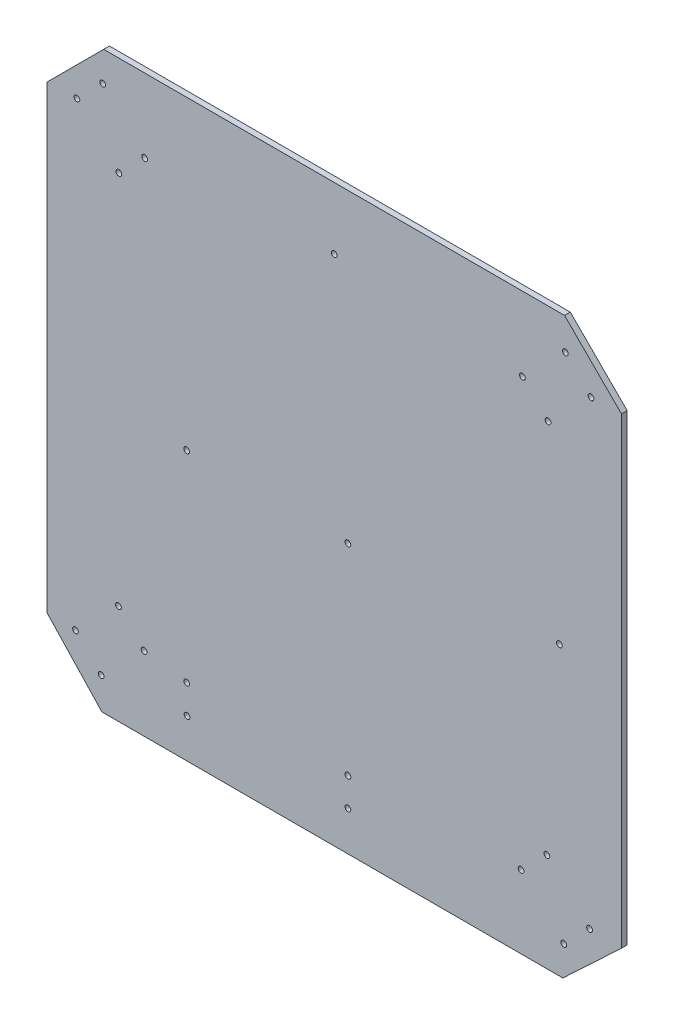
ISO-10303-21;
HEADER;
FILE_DESCRIPTION(('STEP AP214'),'2;1');
FILE_NAME('part.step','',(''),(''),'','','');
FILE_SCHEMA(('AUTOMOTIVE_DESIGN { 1 0 10303 214 1 1 1 1 }'));
ENDSEC;
DATA;
#1=APPLICATION_CONTEXT('core data for automotive mechanical design processes');
#2=APPLICATION_PROTOCOL_DEFINITION('international standard','automotive_design',2000,#1);
#3=PRODUCT_CONTEXT('',#1,'mechanical');
#4=PRODUCT('Part','Part','',(#3));
#5=PRODUCT_RELATED_PRODUCT_CATEGORY('part','',(#4));
#6=PRODUCT_DEFINITION_FORMATION('','',#4);
#7=PRODUCT_DEFINITION_CONTEXT('part definition',#1,'design');
#8=PRODUCT_DEFINITION('design','',#6,#7);
#9=PRODUCT_DEFINITION_SHAPE('','',#8);
#10=(LENGTH_UNIT() NAMED_UNIT(*) SI_UNIT(.MILLI.,.METRE.));
#11=(NAMED_UNIT(*) PLANE_ANGLE_UNIT() SI_UNIT($,.RADIAN.));
#12=(NAMED_UNIT(*) SI_UNIT($,.STERADIAN.) SOLID_ANGLE_UNIT());
#13=UNCERTAINTY_MEASURE_WITH_UNIT(LENGTH_MEASURE(1.E-05),#10,'distance_accuracy_value','');
#14=(GEOMETRIC_REPRESENTATION_CONTEXT(3) GLOBAL_UNCERTAINTY_ASSIGNED_CONTEXT((#13)) GLOBAL_UNIT_ASSIGNED_CONTEXT((#10,
#11,#12)) REPRESENTATION_CONTEXT('',''));
#15=CARTESIAN_POINT('',(0.,0.,0.));
#16=DIRECTION('',(0.,0.,1.));
#17=DIRECTION('',(1.,0.,0.));
#18=AXIS2_PLACEMENT_3D('',#15,#16,#17);
#19=CARTESIAN_POINT('',(0.,0.,5.));
#20=DIRECTION('',(0.,0.,-1.));
#21=DIRECTION('',(-1.,0.,0.));
#22=AXIS2_PLACEMENT_3D('',#19,#20,#21);
#23=PLANE('',#22);
#24=CARTESIAN_POINT('',(0.,196.,5.));
#25=DIRECTION('',(0.,0.,1.));
#26=DIRECTION('',(1.,0.,0.));
#27=AXIS2_PLACEMENT_3D('',#24,#25,#26);
#28=CIRCLE('',#27,2.5);
#29=CARTESIAN_POINT('',(2.50000000000001,196.,5.));
#30=VERTEX_POINT('',#29);
#31=EDGE_CURVE('E301',#30,#30,#28,.T.);
#32=ORIENTED_EDGE('',*,*,#31,.F.);
#33=EDGE_LOOP('',(#32));
#34=FACE_BOUND('',#33,.T.);
#35=CARTESIAN_POINT('',(196.,0.,5.));
#36=DIRECTION('',(0.,0.,1.));
#37=DIRECTION('',(1.,0.,0.));
#38=AXIS2_PLACEMENT_3D('',#35,#36,#37);
#39=CIRCLE('',#38,2.5);
#40=CARTESIAN_POINT('',(198.5,0.,5.));
#41=VERTEX_POINT('',#40);
#42=EDGE_CURVE('E295',#41,#41,#39,.T.);
#43=ORIENTED_EDGE('',*,*,#42,.F.);
#44=EDGE_LOOP('',(#43));
#45=FACE_BOUND('',#44,.T.);
#46=CARTESIAN_POINT('',(12.,-215.715271889631,5.));
#47=DIRECTION('',(0.,0.,1.));
#48=DIRECTION('',(1.,0.,0.));
#49=AXIS2_PLACEMENT_3D('',#46,#47,#48);
#50=CIRCLE('',#49,2.5);
#51=CARTESIAN_POINT('',(14.5,-215.715271889631,5.));
#52=VERTEX_POINT('',#51);
#53=EDGE_CURVE('E290',#52,#52,#50,.T.);
#54=ORIENTED_EDGE('',*,*,#53,.F.);
#55=EDGE_LOOP('',(#54));
#56=FACE_BOUND('',#55,.T.);
#57=CARTESIAN_POINT('',(12.,-191.,5.));
#58=DIRECTION('',(0.,0.,1.));
#59=DIRECTION('',(1.,0.,0.));
#60=AXIS2_PLACEMENT_3D('',#57,#58,#59);
#61=CIRCLE('',#60,2.5);
#62=CARTESIAN_POINT('',(14.5,-191.,5.));
#63=VERTEX_POINT('',#62);
#64=EDGE_CURVE('E284',#63,#63,#61,.T.);
#65=ORIENTED_EDGE('',*,*,#64,.F.);
#66=EDGE_LOOP('',(#65));
#67=FACE_BOUND('',#66,.T.);
#68=CARTESIAN_POINT('',(12.,-16.,5.));
#69=DIRECTION('',(0.,0.,1.));
#70=DIRECTION('',(1.,0.,0.));
#71=AXIS2_PLACEMENT_3D('',#68,#69,#70);
#72=CIRCLE('',#71,2.49999999999999);
#73=CARTESIAN_POINT('',(14.5,-16.,5.));
#74=VERTEX_POINT('',#73);
#75=EDGE_CURVE('E277',#74,#74,#72,.T.);
#76=ORIENTED_EDGE('',*,*,#75,.F.);
#77=EDGE_LOOP('',(#76));
#78=FACE_BOUND('',#77,.T.);
#79=CARTESIAN_POINT('',(-128.,-216.,5.));
#80=DIRECTION('',(0.,0.,1.));
#81=DIRECTION('',(1.,0.,0.));
#82=AXIS2_PLACEMENT_3D('',#79,#80,#81);
#83=CIRCLE('',#82,2.5);
#84=CARTESIAN_POINT('',(-125.5,-216.,5.));
#85=VERTEX_POINT('',#84);
#86=EDGE_CURVE('E272',#85,#85,#83,.T.);
#87=ORIENTED_EDGE('',*,*,#86,.F.);
#88=EDGE_LOOP('',(#87));
#89=FACE_BOUND('',#88,.T.);
#90=CARTESIAN_POINT('',(-128.284639799697,-191.,5.));
#91=DIRECTION('',(0.,0.,1.));
#92=DIRECTION('',(1.,0.,0.));
#93=AXIS2_PLACEMENT_3D('',#90,#91,#92);
#94=CIRCLE('',#93,2.5);
#95=CARTESIAN_POINT('',(-125.784639799697,-191.,5.));
#96=VERTEX_POINT('',#95);
#97=EDGE_CURVE('E266',#96,#96,#94,.T.);
#98=ORIENTED_EDGE('',*,*,#97,.F.);
#99=EDGE_LOOP('',(#98));
#100=FACE_BOUND('',#99,.T.);
#101=CARTESIAN_POINT('',(-128.284639799697,-16.,5.));
#102=DIRECTION('',(0.,0.,1.));
#103=DIRECTION('',(1.,0.,0.));
#104=AXIS2_PLACEMENT_3D('',#101,#102,#103);
#105=CIRCLE('',#104,2.5);
#106=CARTESIAN_POINT('',(-125.784639799697,-16.,5.));
#107=VERTEX_POINT('',#106);
#108=EDGE_CURVE('E259',#107,#107,#105,.T.);
#109=ORIENTED_EDGE('',*,*,#108,.F.);
#110=EDGE_LOOP('',(#109));
#111=FACE_BOUND('',#110,.T.);
#112=CARTESIAN_POINT('',(222.253825997563,-201.338953508415,5.));
#113=DIRECTION('',(0.,0.,1.));
#114=DIRECTION('',(1.,0.,0.));
#115=AXIS2_PLACEMENT_3D('',#112,#113,#114);
#116=CIRCLE('',#115,2.49999999999991);
#117=CARTESIAN_POINT('',(224.753825997563,-201.338953508415,5.));
#118=VERTEX_POINT('',#117);
#119=EDGE_CURVE('E197',#118,#118,#116,.T.);
#120=ORIENTED_EDGE('',*,*,#119,.F.);
#121=EDGE_LOOP('',(#120));
#122=FACE_BOUND('',#121,.T.);
#123=CARTESIAN_POINT('',(-187.659880850275,-163.046698366614,5.));
#124=DIRECTION('',(0.,0.,1.));
#125=DIRECTION('',(1.,0.,0.));
#126=AXIS2_PLACEMENT_3D('',#123,#124,#125);
#127=CIRCLE('',#126,2.49999999999979);
#128=CARTESIAN_POINT('',(-185.159880850275,-163.046698366614,5.));
#129=VERTEX_POINT('',#128);
#130=EDGE_CURVE('E208',#129,#129,#127,.T.);
#131=ORIENTED_EDGE('',*,*,#130,.F.);
#132=EDGE_LOOP('',(#131));
#133=FACE_BOUND('',#132,.T.);
#134=CARTESIAN_POINT('',(201.196010764225,222.516316524821,5.));
#135=DIRECTION('',(0.,0.,1.));
#136=DIRECTION('',(1.,0.,0.));
#137=AXIS2_PLACEMENT_3D('',#134,#135,#136);
#138=CIRCLE('',#137,2.50000000000002);
#139=CARTESIAN_POINT('',(203.696010764225,222.516316524821,5.));
#140=VERTEX_POINT('',#139);
#141=EDGE_CURVE('E179',#140,#140,#138,.T.);
#142=ORIENTED_EDGE('',*,*,#141,.F.);
#143=EDGE_LOOP('',(#142));
#144=FACE_BOUND('',#143,.T.);
#145=CARTESIAN_POINT('',(-187.311960925031,163.528745218922,5.));
#146=DIRECTION('',(0.,0.,1.));
#147=DIRECTION('',(1.,0.,0.));
#148=AXIS2_PLACEMENT_3D('',#145,#146,#147);
#149=CIRCLE('',#148,2.5);
#150=CARTESIAN_POINT('',(-184.811960925031,163.528745218922,5.));
#151=VERTEX_POINT('',#150);
#152=EDGE_CURVE('E185',#151,#151,#149,.T.);
#153=ORIENTED_EDGE('',*,*,#152,.F.);
#154=EDGE_LOOP('',(#153));
#155=FACE_BOUND('',#154,.T.);
#156=CARTESIAN_POINT('',(-164.861320622359,185.979385521595,5.));
#157=DIRECTION('',(0.,0.,1.));
#158=DIRECTION('',(1.,0.,0.));
#159=AXIS2_PLACEMENT_3D('',#156,#157,#158);
#160=CIRCLE('',#159,2.5);
#161=CARTESIAN_POINT('',(-162.361320622359,185.979385521595,5.));
#162=VERTEX_POINT('',#161);
#163=EDGE_CURVE('E251',#162,#162,#160,.T.);
#164=ORIENTED_EDGE('',*,*,#163,.F.);
#165=EDGE_LOOP('',(#164));
#166=FACE_BOUND('',#165,.T.);
#167=CARTESIAN_POINT('',(-202.724854759024,-222.548882873812,5.));
#168=DIRECTION('',(0.,0.,1.));
#169=DIRECTION('',(1.,0.,0.));
#170=AXIS2_PLACEMENT_3D('',#167,#168,#169);
#171=CIRCLE('',#170,2.50000000000006);
#172=CARTESIAN_POINT('',(-200.224854759024,-222.548882873812,5.));
#173=VERTEX_POINT('',#172);
#174=EDGE_CURVE('E241',#173,#173,#171,.T.);
#175=ORIENTED_EDGE('',*,*,#174,.F.);
#176=EDGE_LOOP('',(#175));
#177=FACE_BOUND('',#176,.T.);
#178=CARTESIAN_POINT('',(186.12725815601,163.015088849819,5.));
#179=DIRECTION('',(0.,0.,1.));
#180=DIRECTION('',(1.,0.,0.));
#181=AXIS2_PLACEMENT_3D('',#178,#179,#180);
#182=CIRCLE('',#181,2.49999999999982);
#183=CARTESIAN_POINT('',(188.62725815601,163.015088849819,5.));
#184=VERTEX_POINT('',#183);
#185=EDGE_CURVE('E233',#184,#184,#182,.T.);
#186=ORIENTED_EDGE('',*,*,#185,.F.);
#187=EDGE_LOOP('',(#186));
#188=FACE_BOUND('',#187,.T.);
#189=CARTESIAN_POINT('',(162.657933466483,-186.649059246577,5.));
#190=DIRECTION('',(0.,0.,1.));
#191=DIRECTION('',(1.,0.,0.));
#192=AXIS2_PLACEMENT_3D('',#189,#190,#191);
#193=CIRCLE('',#192,2.50000000000008);
#194=CARTESIAN_POINT('',(165.157933466483,-186.649059246577,5.));
#195=VERTEX_POINT('',#194);
#196=EDGE_CURVE('E220',#195,#195,#193,.T.);
#197=ORIENTED_EDGE('',*,*,#196,.F.);
#198=EDGE_LOOP('',(#197));
#199=FACE_BOUND('',#198,.T.);
#200=CARTESIAN_POINT('',(-223.784016087509,201.333375784836,5.));
#201=DIRECTION('',(0.,0.,1.));
#202=DIRECTION('',(1.,0.,0.));
#203=AXIS2_PLACEMENT_3D('',#200,#201,#202);
#204=CIRCLE('',#203,2.49999999999997);
#205=CARTESIAN_POINT('',(-221.284016087509,201.333375784836,5.));
#206=VERTEX_POINT('',#205);
#207=EDGE_CURVE('E163',#206,#206,#204,.T.);
#208=ORIENTED_EDGE('',*,*,#207,.F.);
#209=EDGE_LOOP('',(#208));
#210=FACE_BOUND('',#209,.T.);
#211=DIRECTION('',(0.,-1.,0.));
#212=VECTOR('',#211,1.);
#213=CARTESIAN_POINT('',(-250.,-250.,5.));
#214=LINE('',#213,#212);
#215=CARTESIAN_POINT('',(-250.,200.502525316942,5.));
#216=VERTEX_POINT('',#215);
#217=CARTESIAN_POINT('',(-250.,-198.96828586381,5.));
#218=VERTEX_POINT('',#217);
#219=EDGE_CURVE('E43',#216,#218,#214,.T.);
#220=ORIENTED_EDGE('',*,*,#219,.T.);
#221=DIRECTION('',(-0.684487615952459,0.729024487659858,0.));
#222=VECTOR('',#221,1.);
#223=CARTESIAN_POINT('',(-232.155988759174,-217.973335552749,5.));
#224=LINE('',#223,#222);
#225=CARTESIAN_POINT('',(-202.085866883328,-250.,5.));
#226=VERTEX_POINT('',#225);
#227=EDGE_CURVE('E148',#226,#218,#224,.T.);
#228=ORIENTED_EDGE('',*,*,#227,.F.);
#229=DIRECTION('',(1.,0.,0.));
#230=VECTOR('',#229,1.);
#231=CARTESIAN_POINT('',(-250.,-250.,5.));
#232=LINE('',#231,#230);
#233=CARTESIAN_POINT('',(198.96828586381,-250.,5.));
#234=VERTEX_POINT('',#233);
#235=EDGE_CURVE('E11',#226,#234,#232,.T.);
#236=ORIENTED_EDGE('',*,*,#235,.T.);
#237=DIRECTION('',(0.729024487659859,0.684487615952458,0.));
#238=VECTOR('',#237,1.);
#239=CARTESIAN_POINT('',(217.973335552748,-232.155988759174,5.));
#240=LINE('',#239,#238);
#241=CARTESIAN_POINT('',(250.,-202.085866883328,5.));
#242=VERTEX_POINT('',#241);
#243=EDGE_CURVE('E147',#234,#242,#240,.T.);
#244=ORIENTED_EDGE('',*,*,#243,.T.);
#245=DIRECTION('',(0.,1.,0.));
#246=VECTOR('',#245,1.);
#247=CARTESIAN_POINT('',(250.,-250.,5.));
#248=LINE('',#247,#246);
#249=CARTESIAN_POINT('',(250.,200.502525316942,5.));
#250=VERTEX_POINT('',#249);
#251=EDGE_CURVE('E134',#242,#250,#248,.T.);
#252=ORIENTED_EDGE('',*,*,#251,.T.);
#253=DIRECTION('',(0.707106781186548,-0.707106781186547,0.));
#254=VECTOR('',#253,1.);
#255=CARTESIAN_POINT('',(225.251262658471,225.251262658471,5.));
#256=LINE('',#255,#254);
#257=CARTESIAN_POINT('',(200.502525316942,250.,5.));
#258=VERTEX_POINT('',#257);
#259=EDGE_CURVE('E111',#258,#250,#256,.T.);
#260=ORIENTED_EDGE('',*,*,#259,.F.);
#261=DIRECTION('',(-1.,0.,0.));
#262=VECTOR('',#261,1.);
#263=CARTESIAN_POINT('',(-250.,250.,5.));
#264=LINE('',#263,#262);
#265=CARTESIAN_POINT('',(-200.502525316942,250.,5.));
#266=VERTEX_POINT('',#265);
#267=EDGE_CURVE('E119',#258,#266,#264,.T.);
#268=ORIENTED_EDGE('',*,*,#267,.T.);
#269=DIRECTION('',(0.707106781186547,0.707106781186549,0.));
#270=VECTOR('',#269,1.);
#271=CARTESIAN_POINT('',(-225.251262658471,225.251262658471,5.));
#272=LINE('',#271,#270);
#273=EDGE_CURVE('E140',#216,#266,#272,.T.);
#274=ORIENTED_EDGE('',*,*,#273,.F.);
#275=EDGE_LOOP('',(#220,#228,#236,#244,#252,#260,#268,#274));
#276=FACE_BOUND('',#275,.T.);
#277=CARTESIAN_POINT('',(185.107147979515,-164.196993244807,5.));
#278=DIRECTION('',(0.,0.,-1.));
#279=DIRECTION('',(-1.,0.,0.));
#280=AXIS2_PLACEMENT_3D('',#277,#278,#279);
#281=CIRCLE('',#280,2.49999999999985);
#282=CARTESIAN_POINT('',(182.607147979515,-164.196993244807,5.));
#283=VERTEX_POINT('',#282);
#284=EDGE_CURVE('E227',#283,#283,#281,.T.);
#285=ORIENTED_EDGE('',*,*,#284,.T.);
#286=EDGE_LOOP('',(#285));
#287=FACE_BOUND('',#286,.T.);
#288=CARTESIAN_POINT('',(-165.349658972528,-185.636884283638,5.));
#289=DIRECTION('',(0.,0.,1.));
#290=DIRECTION('',(1.,0.,0.));
#291=AXIS2_PLACEMENT_3D('',#288,#289,#290);
#292=CIRCLE('',#291,2.50000000000002);
#293=CARTESIAN_POINT('',(-162.849658972528,-185.636884283638,5.));
#294=VERTEX_POINT('',#293);
#295=EDGE_CURVE('E209',#294,#294,#292,.F.);
#296=ORIENTED_EDGE('',*,*,#295,.T.);
#297=EDGE_LOOP('',(#296));
#298=FACE_BOUND('',#297,.T.);
#299=CARTESIAN_POINT('',(-225.035076636771,-199.958696956789,5.));
#300=DIRECTION('',(0.,0.,1.));
#301=DIRECTION('',(1.,0.,0.));
#302=AXIS2_PLACEMENT_3D('',#299,#300,#301);
#303=CIRCLE('',#302,2.5);
#304=CARTESIAN_POINT('',(-222.535076636771,-199.958696956789,5.));
#305=VERTEX_POINT('',#304);
#306=EDGE_CURVE('E240',#305,#305,#303,.F.);
#307=ORIENTED_EDGE('',*,*,#306,.T.);
#308=EDGE_LOOP('',(#307));
#309=FACE_BOUND('',#308,.T.);
#310=CARTESIAN_POINT('',(-201.333375784836,223.784016087509,5.));
#311=DIRECTION('',(0.,0.,1.));
#312=DIRECTION('',(1.,0.,0.));
#313=AXIS2_PLACEMENT_3D('',#310,#311,#312);
#314=CIRCLE('',#313,2.50000000000002);
#315=CARTESIAN_POINT('',(-198.833375784836,223.784016087509,5.));
#316=VERTEX_POINT('',#315);
#317=EDGE_CURVE('E166',#316,#316,#314,.F.);
#318=ORIENTED_EDGE('',*,*,#317,.T.);
#319=EDGE_LOOP('',(#318));
#320=FACE_BOUND('',#319,.T.);
#321=CARTESIAN_POINT('',(223.504797990668,199.924713826356,5.));
#322=DIRECTION('',(0.,0.,1.));
#323=DIRECTION('',(1.,0.,0.));
#324=AXIS2_PLACEMENT_3D('',#321,#322,#323);
#325=CIRCLE('',#324,2.49999999999993);
#326=CARTESIAN_POINT('',(226.004797990668,199.924713826356,5.));
#327=VERTEX_POINT('',#326);
#328=EDGE_CURVE('E172',#327,#327,#325,.F.);
#329=ORIENTED_EDGE('',*,*,#328,.T.);
#330=EDGE_LOOP('',(#329));
#331=FACE_BOUND('',#330,.T.);
#332=CARTESIAN_POINT('',(199.804611484531,-223.791019510186,5.));
#333=DIRECTION('',(0.,0.,1.));
#334=DIRECTION('',(1.,0.,0.));
#335=AXIS2_PLACEMENT_3D('',#332,#333,#334);
#336=CIRCLE('',#335,2.50000000000002);
#337=CARTESIAN_POINT('',(202.304611484531,-223.791019510186,5.));
#338=VERTEX_POINT('',#337);
#339=EDGE_CURVE('E196',#338,#338,#336,.F.);
#340=ORIENTED_EDGE('',*,*,#339,.T.);
#341=EDGE_LOOP('',(#340));
#342=FACE_BOUND('',#341,.T.);
#343=CARTESIAN_POINT('',(163.818470929568,185.606691548284,5.));
#344=DIRECTION('',(0.,0.,1.));
#345=DIRECTION('',(1.,0.,0.));
#346=AXIS2_PLACEMENT_3D('',#343,#344,#345);
#347=CIRCLE('',#346,2.5);
#348=CARTESIAN_POINT('',(166.318470929568,185.606691548284,5.));
#349=VERTEX_POINT('',#348);
#350=EDGE_CURVE('E173',#349,#349,#347,.F.);
#351=ORIENTED_EDGE('',*,*,#350,.T.);
#352=EDGE_LOOP('',(#351));
#353=FACE_BOUND('',#352,.T.);
#354=ADVANCED_FACE('F34',(#34,#45,#56,#67,#78,#89,#100,#111,#122,#133,#144,#155,#166,#177,#188,
#199,#210,#276,#287,#298,#309,#320,#331,#342,#353),#23,.F.);
#355=CARTESIAN_POINT('',(0.,0.,0.));
#356=DIRECTION('',(0.,0.,-1.));
#357=DIRECTION('',(-1.,0.,0.));
#358=AXIS2_PLACEMENT_3D('',#355,#356,#357);
#359=PLANE('',#358);
#360=CARTESIAN_POINT('',(0.,196.,0.));
#361=DIRECTION('',(0.,0.,1.));
#362=DIRECTION('',(1.,0.,0.));
#363=AXIS2_PLACEMENT_3D('',#360,#361,#362);
#364=CIRCLE('',#363,2.5);
#365=CARTESIAN_POINT('',(2.50000000000001,196.,0.));
#366=VERTEX_POINT('',#365);
#367=EDGE_CURVE('E281',#366,#366,#364,.T.);
#368=ORIENTED_EDGE('',*,*,#367,.T.);
#369=EDGE_LOOP('',(#368));
#370=FACE_BOUND('',#369,.T.);
#371=CARTESIAN_POINT('',(196.,0.,0.));
#372=DIRECTION('',(0.,0.,1.));
#373=DIRECTION('',(1.,0.,0.));
#374=AXIS2_PLACEMENT_3D('',#371,#372,#373);
#375=CIRCLE('',#374,2.5);
#376=CARTESIAN_POINT('',(198.5,0.,0.));
#377=VERTEX_POINT('',#376);
#378=EDGE_CURVE('E298',#377,#377,#375,.T.);
#379=ORIENTED_EDGE('',*,*,#378,.T.);
#380=EDGE_LOOP('',(#379));
#381=FACE_BOUND('',#380,.T.);
#382=CARTESIAN_POINT('',(12.,-215.715271889631,0.));
#383=DIRECTION('',(0.,0.,1.));
#384=DIRECTION('',(1.,0.,0.));
#385=AXIS2_PLACEMENT_3D('',#382,#383,#384);
#386=CIRCLE('',#385,2.5);
#387=CARTESIAN_POINT('',(14.5,-215.715271889631,0.));
#388=VERTEX_POINT('',#387);
#389=EDGE_CURVE('E263',#388,#388,#386,.T.);
#390=ORIENTED_EDGE('',*,*,#389,.T.);
#391=EDGE_LOOP('',(#390));
#392=FACE_BOUND('',#391,.T.);
#393=CARTESIAN_POINT('',(12.,-191.,0.));
#394=DIRECTION('',(0.,0.,1.));
#395=DIRECTION('',(1.,0.,0.));
#396=AXIS2_PLACEMENT_3D('',#393,#394,#395);
#397=CIRCLE('',#396,2.5);
#398=CARTESIAN_POINT('',(14.5,-191.,0.));
#399=VERTEX_POINT('',#398);
#400=EDGE_CURVE('E287',#399,#399,#397,.T.);
#401=ORIENTED_EDGE('',*,*,#400,.T.);
#402=EDGE_LOOP('',(#401));
#403=FACE_BOUND('',#402,.T.);
#404=CARTESIAN_POINT('',(12.,-16.,0.));
#405=DIRECTION('',(0.,0.,1.));
#406=DIRECTION('',(1.,0.,0.));
#407=AXIS2_PLACEMENT_3D('',#404,#405,#406);
#408=CIRCLE('',#407,2.49999999999999);
#409=CARTESIAN_POINT('',(14.5,-16.,0.));
#410=VERTEX_POINT('',#409);
#411=EDGE_CURVE('E280',#410,#410,#408,.T.);
#412=ORIENTED_EDGE('',*,*,#411,.T.);
#413=EDGE_LOOP('',(#412));
#414=FACE_BOUND('',#413,.T.);
#415=CARTESIAN_POINT('',(-128.,-216.,0.));
#416=DIRECTION('',(0.,0.,1.));
#417=DIRECTION('',(1.,0.,0.));
#418=AXIS2_PLACEMENT_3D('',#415,#416,#417);
#419=CIRCLE('',#418,2.5);
#420=CARTESIAN_POINT('',(-125.5,-216.,0.));
#421=VERTEX_POINT('',#420);
#422=EDGE_CURVE('E221',#421,#421,#419,.T.);
#423=ORIENTED_EDGE('',*,*,#422,.T.);
#424=EDGE_LOOP('',(#423));
#425=FACE_BOUND('',#424,.T.);
#426=CARTESIAN_POINT('',(-128.284639799697,-191.,0.));
#427=DIRECTION('',(0.,0.,1.));
#428=DIRECTION('',(1.,0.,0.));
#429=AXIS2_PLACEMENT_3D('',#426,#427,#428);
#430=CIRCLE('',#429,2.5);
#431=CARTESIAN_POINT('',(-125.784639799697,-191.,0.));
#432=VERTEX_POINT('',#431);
#433=EDGE_CURVE('E269',#432,#432,#430,.T.);
#434=ORIENTED_EDGE('',*,*,#433,.T.);
#435=EDGE_LOOP('',(#434));
#436=FACE_BOUND('',#435,.T.);
#437=CARTESIAN_POINT('',(-128.284639799697,-16.,0.));
#438=DIRECTION('',(0.,0.,1.));
#439=DIRECTION('',(1.,0.,0.));
#440=AXIS2_PLACEMENT_3D('',#437,#438,#439);
#441=CIRCLE('',#440,2.5);
#442=CARTESIAN_POINT('',(-125.784639799697,-16.,0.));
#443=VERTEX_POINT('',#442);
#444=EDGE_CURVE('E262',#443,#443,#441,.T.);
#445=ORIENTED_EDGE('',*,*,#444,.T.);
#446=EDGE_LOOP('',(#445));
#447=FACE_BOUND('',#446,.T.);
#448=CARTESIAN_POINT('',(199.804611484531,-223.791019510186,0.));
#449=DIRECTION('',(0.,0.,1.));
#450=DIRECTION('',(1.,0.,0.));
#451=AXIS2_PLACEMENT_3D('',#448,#449,#450);
#452=CIRCLE('',#451,2.50000000000002);
#453=CARTESIAN_POINT('',(202.304611484531,-223.791019510186,0.));
#454=VERTEX_POINT('',#453);
#455=EDGE_CURVE('E193',#454,#454,#452,.F.);
#456=ORIENTED_EDGE('',*,*,#455,.F.);
#457=EDGE_LOOP('',(#456));
#458=FACE_BOUND('',#457,.T.);
#459=CARTESIAN_POINT('',(222.253825997563,-201.338953508415,0.));
#460=DIRECTION('',(0.,0.,1.));
#461=DIRECTION('',(1.,0.,0.));
#462=AXIS2_PLACEMENT_3D('',#459,#460,#461);
#463=CIRCLE('',#462,2.49999999999991);
#464=CARTESIAN_POINT('',(224.753825997563,-201.338953508415,0.));
#465=VERTEX_POINT('',#464);
#466=EDGE_CURVE('E212',#465,#465,#463,.T.);
#467=ORIENTED_EDGE('',*,*,#466,.T.);
#468=EDGE_LOOP('',(#467));
#469=FACE_BOUND('',#468,.T.);
#470=CARTESIAN_POINT('',(-187.659880850275,-163.046698366614,0.));
#471=DIRECTION('',(0.,0.,1.));
#472=DIRECTION('',(1.,0.,0.));
#473=AXIS2_PLACEMENT_3D('',#470,#471,#472);
#474=CIRCLE('',#473,2.49999999999979);
#475=CARTESIAN_POINT('',(-185.159880850275,-163.046698366614,0.));
#476=VERTEX_POINT('',#475);
#477=EDGE_CURVE('E205',#476,#476,#474,.T.);
#478=ORIENTED_EDGE('',*,*,#477,.T.);
#479=EDGE_LOOP('',(#478));
#480=FACE_BOUND('',#479,.T.);
#481=CARTESIAN_POINT('',(-201.333375784836,223.784016087509,0.));
#482=DIRECTION('',(0.,0.,1.));
#483=DIRECTION('',(1.,0.,0.));
#484=AXIS2_PLACEMENT_3D('',#481,#482,#483);
#485=CIRCLE('',#484,2.50000000000002);
#486=CARTESIAN_POINT('',(-198.833375784836,223.784016087509,0.));
#487=VERTEX_POINT('',#486);
#488=EDGE_CURVE('E188',#487,#487,#485,.F.);
#489=ORIENTED_EDGE('',*,*,#488,.F.);
#490=EDGE_LOOP('',(#489));
#491=FACE_BOUND('',#490,.T.);
#492=CARTESIAN_POINT('',(-164.861320622359,185.979385521595,0.));
#493=DIRECTION('',(0.,0.,1.));
#494=DIRECTION('',(1.,0.,0.));
#495=AXIS2_PLACEMENT_3D('',#492,#493,#494);
#496=CIRCLE('',#495,2.5);
#497=CARTESIAN_POINT('',(-162.361320622359,185.979385521595,0.));
#498=VERTEX_POINT('',#497);
#499=EDGE_CURVE('E236',#498,#498,#496,.T.);
#500=ORIENTED_EDGE('',*,*,#499,.T.);
#501=EDGE_LOOP('',(#500));
#502=FACE_BOUND('',#501,.T.);
#503=CARTESIAN_POINT('',(-202.724854759024,-222.548882873812,0.));
#504=DIRECTION('',(0.,0.,1.));
#505=DIRECTION('',(1.,0.,0.));
#506=AXIS2_PLACEMENT_3D('',#503,#504,#505);
#507=CIRCLE('',#506,2.50000000000006);
#508=CARTESIAN_POINT('',(-200.224854759024,-222.548882873812,0.));
#509=VERTEX_POINT('',#508);
#510=EDGE_CURVE('E254',#509,#509,#507,.T.);
#511=ORIENTED_EDGE('',*,*,#510,.T.);
#512=EDGE_LOOP('',(#511));
#513=FACE_BOUND('',#512,.T.);
#514=CARTESIAN_POINT('',(-165.349658972528,-185.636884283638,0.));
#515=DIRECTION('',(0.,0.,1.));
#516=DIRECTION('',(1.,0.,0.));
#517=AXIS2_PLACEMENT_3D('',#514,#515,#516);
#518=CIRCLE('',#517,2.50000000000002);
#519=CARTESIAN_POINT('',(-162.849658972528,-185.636884283638,0.));
#520=VERTEX_POINT('',#519);
#521=EDGE_CURVE('E244',#520,#520,#518,.F.);
#522=ORIENTED_EDGE('',*,*,#521,.F.);
#523=EDGE_LOOP('',(#522));
#524=FACE_BOUND('',#523,.T.);
#525=CARTESIAN_POINT('',(186.12725815601,163.015088849819,0.));
#526=DIRECTION('',(0.,0.,1.));
#527=DIRECTION('',(1.,0.,0.));
#528=AXIS2_PLACEMENT_3D('',#525,#526,#527);
#529=CIRCLE('',#528,2.49999999999982);
#530=CARTESIAN_POINT('',(188.62725815601,163.015088849819,0.));
#531=VERTEX_POINT('',#530);
#532=EDGE_CURVE('E230',#531,#531,#529,.T.);
#533=ORIENTED_EDGE('',*,*,#532,.T.);
#534=EDGE_LOOP('',(#533));
#535=FACE_BOUND('',#534,.T.);
#536=DIRECTION('',(-0.684487615952459,0.729024487659858,0.));
#537=VECTOR('',#536,1.);
#538=CARTESIAN_POINT('',(-232.155988759174,-217.973335552749,0.));
#539=LINE('',#538,#537);
#540=CARTESIAN_POINT('',(-202.085866883328,-250.,0.));
#541=VERTEX_POINT('',#540);
#542=CARTESIAN_POINT('',(-250.,-198.96828586381,0.));
#543=VERTEX_POINT('',#542);
#544=EDGE_CURVE('E145',#541,#543,#539,.T.);
#545=ORIENTED_EDGE('',*,*,#544,.T.);
#546=DIRECTION('',(0.,-1.,0.));
#547=VECTOR('',#546,1.);
#548=CARTESIAN_POINT('',(-250.,-250.,0.));
#549=LINE('',#548,#547);
#550=CARTESIAN_POINT('',(-250.,200.502525316942,0.));
#551=VERTEX_POINT('',#550);
#552=EDGE_CURVE('E125',#551,#543,#549,.T.);
#553=ORIENTED_EDGE('',*,*,#552,.F.);
#554=DIRECTION('',(0.707106781186547,0.707106781186549,0.));
#555=VECTOR('',#554,1.);
#556=CARTESIAN_POINT('',(-225.251262658471,225.251262658471,0.));
#557=LINE('',#556,#555);
#558=CARTESIAN_POINT('',(-200.502525316942,250.,0.));
#559=VERTEX_POINT('',#558);
#560=EDGE_CURVE('E124',#551,#559,#557,.T.);
#561=ORIENTED_EDGE('',*,*,#560,.T.);
#562=DIRECTION('',(-1.,0.,0.));
#563=VECTOR('',#562,1.);
#564=CARTESIAN_POINT('',(-250.,250.,0.));
#565=LINE('',#564,#563);
#566=CARTESIAN_POINT('',(200.502525316942,250.,0.));
#567=VERTEX_POINT('',#566);
#568=EDGE_CURVE('E117',#567,#559,#565,.T.);
#569=ORIENTED_EDGE('',*,*,#568,.F.);
#570=DIRECTION('',(0.707106781186548,-0.707106781186547,0.));
#571=VECTOR('',#570,1.);
#572=CARTESIAN_POINT('',(225.251262658471,225.251262658471,0.));
#573=LINE('',#572,#571);
#574=CARTESIAN_POINT('',(250.,200.502525316942,0.));
#575=VERTEX_POINT('',#574);
#576=EDGE_CURVE('E100',#567,#575,#573,.T.);
#577=ORIENTED_EDGE('',*,*,#576,.T.);
#578=DIRECTION('',(0.,1.,0.));
#579=VECTOR('',#578,1.);
#580=CARTESIAN_POINT('',(250.,-250.,0.));
#581=LINE('',#580,#579);
#582=CARTESIAN_POINT('',(250.,-202.085866883328,0.));
#583=VERTEX_POINT('',#582);
#584=EDGE_CURVE('E126',#583,#575,#581,.T.);
#585=ORIENTED_EDGE('',*,*,#584,.F.);
#586=DIRECTION('',(0.729024487659859,0.684487615952458,0.));
#587=VECTOR('',#586,1.);
#588=CARTESIAN_POINT('',(217.973335552748,-232.155988759174,0.));
#589=LINE('',#588,#587);
#590=CARTESIAN_POINT('',(198.96828586381,-250.,0.));
#591=VERTEX_POINT('',#590);
#592=EDGE_CURVE('E156',#591,#583,#589,.T.);
#593=ORIENTED_EDGE('',*,*,#592,.F.);
#594=DIRECTION('',(1.,0.,0.));
#595=VECTOR('',#594,1.);
#596=CARTESIAN_POINT('',(-250.,-250.,0.));
#597=LINE('',#596,#595);
#598=EDGE_CURVE('E38',#541,#591,#597,.T.);
#599=ORIENTED_EDGE('',*,*,#598,.F.);
#600=EDGE_LOOP('',(#545,#553,#561,#569,#577,#585,#593,#599));
#601=FACE_BOUND('',#600,.T.);
#602=CARTESIAN_POINT('',(-223.784016087509,201.333375784836,0.));
#603=DIRECTION('',(0.,0.,1.));
#604=DIRECTION('',(1.,0.,0.));
#605=AXIS2_PLACEMENT_3D('',#602,#603,#604);
#606=CIRCLE('',#605,2.49999999999997);
#607=CARTESIAN_POINT('',(-221.284016087509,201.333375784836,0.));
#608=VERTEX_POINT('',#607);
#609=EDGE_CURVE('E150',#608,#608,#606,.T.);
#610=ORIENTED_EDGE('',*,*,#609,.T.);
#611=EDGE_LOOP('',(#610));
#612=FACE_BOUND('',#611,.T.);
#613=CARTESIAN_POINT('',(162.657933466483,-186.649059246577,0.));
#614=DIRECTION('',(0.,0.,1.));
#615=DIRECTION('',(1.,0.,0.));
#616=AXIS2_PLACEMENT_3D('',#613,#614,#615);
#617=CIRCLE('',#616,2.50000000000008);
#618=CARTESIAN_POINT('',(165.157933466483,-186.649059246577,0.));
#619=VERTEX_POINT('',#618);
#620=EDGE_CURVE('E217',#619,#619,#617,.T.);
#621=ORIENTED_EDGE('',*,*,#620,.T.);
#622=EDGE_LOOP('',(#621));
#623=FACE_BOUND('',#622,.T.);
#624=CARTESIAN_POINT('',(185.107147979515,-164.196993244807,0.));
#625=DIRECTION('',(0.,0.,-1.));
#626=DIRECTION('',(-1.,0.,0.));
#627=AXIS2_PLACEMENT_3D('',#624,#625,#626);
#628=CIRCLE('',#627,2.49999999999985);
#629=CARTESIAN_POINT('',(182.607147979515,-164.196993244807,0.));
#630=VERTEX_POINT('',#629);
#631=EDGE_CURVE('E224',#630,#630,#628,.T.);
#632=ORIENTED_EDGE('',*,*,#631,.F.);
#633=EDGE_LOOP('',(#632));
#634=FACE_BOUND('',#633,.T.);
#635=CARTESIAN_POINT('',(-225.035076636771,-199.958696956789,0.));
#636=DIRECTION('',(0.,0.,1.));
#637=DIRECTION('',(1.,0.,0.));
#638=AXIS2_PLACEMENT_3D('',#635,#636,#637);
#639=CIRCLE('',#638,2.5);
#640=CARTESIAN_POINT('',(-222.535076636771,-199.958696956789,0.));
#641=VERTEX_POINT('',#640);
#642=EDGE_CURVE('E237',#641,#641,#639,.F.);
#643=ORIENTED_EDGE('',*,*,#642,.F.);
#644=EDGE_LOOP('',(#643));
#645=FACE_BOUND('',#644,.T.);
#646=CARTESIAN_POINT('',(-187.311960925031,163.528745218922,0.));
#647=DIRECTION('',(0.,0.,1.));
#648=DIRECTION('',(1.,0.,0.));
#649=AXIS2_PLACEMENT_3D('',#646,#647,#648);
#650=CIRCLE('',#649,2.5);
#651=CARTESIAN_POINT('',(-184.811960925031,163.528745218922,0.));
#652=VERTEX_POINT('',#651);
#653=EDGE_CURVE('E182',#652,#652,#650,.T.);
#654=ORIENTED_EDGE('',*,*,#653,.T.);
#655=EDGE_LOOP('',(#654));
#656=FACE_BOUND('',#655,.T.);
#657=CARTESIAN_POINT('',(201.196010764225,222.516316524821,0.));
#658=DIRECTION('',(0.,0.,1.));
#659=DIRECTION('',(1.,0.,0.));
#660=AXIS2_PLACEMENT_3D('',#657,#658,#659);
#661=CIRCLE('',#660,2.50000000000002);
#662=CARTESIAN_POINT('',(203.696010764225,222.516316524821,0.));
#663=VERTEX_POINT('',#662);
#664=EDGE_CURVE('E176',#663,#663,#661,.T.);
#665=ORIENTED_EDGE('',*,*,#664,.T.);
#666=EDGE_LOOP('',(#665));
#667=FACE_BOUND('',#666,.T.);
#668=CARTESIAN_POINT('',(223.504797990668,199.924713826356,0.));
#669=DIRECTION('',(0.,0.,1.));
#670=DIRECTION('',(1.,0.,0.));
#671=AXIS2_PLACEMENT_3D('',#668,#669,#670);
#672=CIRCLE('',#671,2.49999999999993);
#673=CARTESIAN_POINT('',(226.004797990668,199.924713826356,0.));
#674=VERTEX_POINT('',#673);
#675=EDGE_CURVE('E169',#674,#674,#672,.F.);
#676=ORIENTED_EDGE('',*,*,#675,.F.);
#677=EDGE_LOOP('',(#676));
#678=FACE_BOUND('',#677,.T.);
#679=CARTESIAN_POINT('',(163.818470929568,185.606691548284,0.));
#680=DIRECTION('',(0.,0.,1.));
#681=DIRECTION('',(1.,0.,0.));
#682=AXIS2_PLACEMENT_3D('',#679,#680,#681);
#683=CIRCLE('',#682,2.5);
#684=CARTESIAN_POINT('',(166.318470929568,185.606691548284,0.));
#685=VERTEX_POINT('',#684);
#686=EDGE_CURVE('E200',#685,#685,#683,.F.);
#687=ORIENTED_EDGE('',*,*,#686,.F.);
#688=EDGE_LOOP('',(#687));
#689=FACE_BOUND('',#688,.T.);
#690=ADVANCED_FACE('F121',(#370,#381,#392,#403,#414,#425,#436,#447,#458,#469,#480,#491,#502,
#513,#524,#535,#601,#612,#623,#634,#645,#656,#667,#678,#689),#359,.T.);
#691=CARTESIAN_POINT('',(250.,-250.,5.));
#692=DIRECTION('',(-1.,0.,0.));
#693=DIRECTION('',(0.,0.,1.));
#694=AXIS2_PLACEMENT_3D('',#691,#692,#693);
#695=PLANE('',#694);
#696=DIRECTION('',(0.,0.,1.));
#697=VECTOR('',#696,1.);
#698=CARTESIAN_POINT('',(250.,-202.085866883328,0.));
#699=LINE('',#698,#697);
#700=EDGE_CURVE('E155',#583,#242,#699,.T.);
#701=ORIENTED_EDGE('',*,*,#700,.F.);
#702=ORIENTED_EDGE('',*,*,#584,.T.);
#703=DIRECTION('',(0.,0.,1.));
#704=VECTOR('',#703,1.);
#705=CARTESIAN_POINT('',(250.,200.502525316942,0.));
#706=LINE('',#705,#704);
#707=EDGE_CURVE('E106',#575,#250,#706,.T.);
#708=ORIENTED_EDGE('',*,*,#707,.T.);
#709=ORIENTED_EDGE('',*,*,#251,.F.);
#710=EDGE_LOOP('',(#701,#702,#708,#709));
#711=FACE_BOUND('',#710,.T.);
#712=ADVANCED_FACE('F36',(#711),#695,.F.);
#713=CARTESIAN_POINT('',(-250.,-250.,5.));
#714=DIRECTION('',(0.,1.,0.));
#715=DIRECTION('',(0.,0.,1.));
#716=AXIS2_PLACEMENT_3D('',#713,#714,#715);
#717=PLANE('',#716);
#718=ORIENTED_EDGE('',*,*,#235,.F.);
#719=DIRECTION('',(0.,0.,1.));
#720=VECTOR('',#719,1.);
#721=CARTESIAN_POINT('',(-202.085866883328,-250.,0.));
#722=LINE('',#721,#720);
#723=EDGE_CURVE('E143',#541,#226,#722,.T.);
#724=ORIENTED_EDGE('',*,*,#723,.F.);
#725=ORIENTED_EDGE('',*,*,#598,.T.);
#726=DIRECTION('',(0.,0.,1.));
#727=VECTOR('',#726,1.);
#728=CARTESIAN_POINT('',(198.96828586381,-250.,0.));
#729=LINE('',#728,#727);
#730=EDGE_CURVE('E152',#591,#234,#729,.T.);
#731=ORIENTED_EDGE('',*,*,#730,.T.);
#732=EDGE_LOOP('',(#718,#724,#725,#731));
#733=FACE_BOUND('',#732,.T.);
#734=ADVANCED_FACE('F426',(#733),#717,.F.);
#735=CARTESIAN_POINT('',(-250.,250.,5.));
#736=DIRECTION('',(0.,-1.,0.));
#737=DIRECTION('',(0.,0.,-1.));
#738=AXIS2_PLACEMENT_3D('',#735,#736,#737);
#739=PLANE('',#738);
#740=ORIENTED_EDGE('',*,*,#267,.F.);
#741=DIRECTION('',(0.,0.,1.));
#742=VECTOR('',#741,1.);
#743=CARTESIAN_POINT('',(200.502525316942,250.,0.));
#744=LINE('',#743,#742);
#745=EDGE_CURVE('E103',#567,#258,#744,.T.);
#746=ORIENTED_EDGE('',*,*,#745,.F.);
#747=ORIENTED_EDGE('',*,*,#568,.T.);
#748=DIRECTION('',(0.,0.,1.));
#749=VECTOR('',#748,1.);
#750=CARTESIAN_POINT('',(-200.502525316942,250.,0.));
#751=LINE('',#750,#749);
#752=EDGE_CURVE('E51',#559,#266,#751,.T.);
#753=ORIENTED_EDGE('',*,*,#752,.T.);
#754=EDGE_LOOP('',(#740,#746,#747,#753));
#755=FACE_BOUND('',#754,.T.);
#756=ADVANCED_FACE('F116',(#755),#739,.F.);
#757=CARTESIAN_POINT('',(-250.,-250.,5.));
#758=DIRECTION('',(1.,0.,0.));
#759=DIRECTION('',(0.,0.,-1.));
#760=AXIS2_PLACEMENT_3D('',#757,#758,#759);
#761=PLANE('',#760);
#762=ORIENTED_EDGE('',*,*,#552,.T.);
#763=DIRECTION('',(0.,0.,1.));
#764=VECTOR('',#763,1.);
#765=CARTESIAN_POINT('',(-250.,-198.96828586381,0.));
#766=LINE('',#765,#764);
#767=EDGE_CURVE('E59',#543,#218,#766,.T.);
#768=ORIENTED_EDGE('',*,*,#767,.T.);
#769=ORIENTED_EDGE('',*,*,#219,.F.);
#770=DIRECTION('',(0.,0.,1.));
#771=VECTOR('',#770,1.);
#772=CARTESIAN_POINT('',(-250.,200.502525316942,0.));
#773=LINE('',#772,#771);
#774=EDGE_CURVE('E137',#551,#216,#773,.T.);
#775=ORIENTED_EDGE('',*,*,#774,.F.);
#776=EDGE_LOOP('',(#762,#768,#769,#775));
#777=FACE_BOUND('',#776,.T.);
#778=ADVANCED_FACE('F422',(#777),#761,.F.);
#779=CARTESIAN_POINT('',(-225.251262658471,225.251262658471,0.));
#780=DIRECTION('',(0.707106781186549,-0.707106781186547,0.));
#781=DIRECTION('',(0.707106781186547,0.707106781186549,0.));
#782=AXIS2_PLACEMENT_3D('',#779,#780,#781);
#783=PLANE('',#782);
#784=ORIENTED_EDGE('',*,*,#273,.T.);
#785=ORIENTED_EDGE('',*,*,#752,.F.);
#786=ORIENTED_EDGE('',*,*,#560,.F.);
#787=ORIENTED_EDGE('',*,*,#774,.T.);
#788=EDGE_LOOP('',(#784,#785,#786,#787));
#789=FACE_BOUND('',#788,.T.);
#790=ADVANCED_FACE('F415',(#789),#783,.F.);
#791=CARTESIAN_POINT('',(225.251262658471,225.251262658471,0.));
#792=DIRECTION('',(-0.707106781186547,-0.707106781186548,0.));
#793=DIRECTION('',(0.707106781186548,-0.707106781186547,0.));
#794=AXIS2_PLACEMENT_3D('',#791,#792,#793);
#795=PLANE('',#794);
#796=ORIENTED_EDGE('',*,*,#259,.T.);
#797=ORIENTED_EDGE('',*,*,#707,.F.);
#798=ORIENTED_EDGE('',*,*,#576,.F.);
#799=ORIENTED_EDGE('',*,*,#745,.T.);
#800=EDGE_LOOP('',(#796,#797,#798,#799));
#801=FACE_BOUND('',#800,.T.);
#802=ADVANCED_FACE('F102',(#801),#795,.F.);
#803=CARTESIAN_POINT('',(217.973335552748,-232.155988759174,0.));
#804=DIRECTION('',(0.684487615952458,-0.729024487659859,0.));
#805=DIRECTION('',(0.729024487659859,0.684487615952458,0.));
#806=AXIS2_PLACEMENT_3D('',#803,#804,#805);
#807=PLANE('',#806);
#808=ORIENTED_EDGE('',*,*,#243,.F.);
#809=ORIENTED_EDGE('',*,*,#730,.F.);
#810=ORIENTED_EDGE('',*,*,#592,.T.);
#811=ORIENTED_EDGE('',*,*,#700,.T.);
#812=EDGE_LOOP('',(#808,#809,#810,#811));
#813=FACE_BOUND('',#812,.T.);
#814=ADVANCED_FACE('F414',(#813),#807,.T.);
#815=CARTESIAN_POINT('',(-232.155988759174,-217.973335552749,0.));
#816=DIRECTION('',(0.729024487659858,0.684487615952459,0.));
#817=DIRECTION('',(-0.684487615952459,0.729024487659858,0.));
#818=AXIS2_PLACEMENT_3D('',#815,#816,#817);
#819=PLANE('',#818);
#820=ORIENTED_EDGE('',*,*,#227,.T.);
#821=ORIENTED_EDGE('',*,*,#767,.F.);
#822=ORIENTED_EDGE('',*,*,#544,.F.);
#823=ORIENTED_EDGE('',*,*,#723,.T.);
#824=EDGE_LOOP('',(#820,#821,#822,#823));
#825=FACE_BOUND('',#824,.T.);
#826=ADVANCED_FACE('F410',(#825),#819,.F.);
#827=CARTESIAN_POINT('',(-223.784016087509,201.333375784836,0.));
#828=DIRECTION('',(0.,0.,1.));
#829=DIRECTION('',(1.,0.,0.));
#830=AXIS2_PLACEMENT_3D('',#827,#828,#829);
#831=CYLINDRICAL_SURFACE('',#830,2.49999999999997);
#832=ORIENTED_EDGE('',*,*,#609,.F.);
#833=EDGE_LOOP('',(#832));
#834=FACE_BOUND('',#833,.T.);
#835=ORIENTED_EDGE('',*,*,#207,.T.);
#836=EDGE_LOOP('',(#835));
#837=FACE_BOUND('',#836,.T.);
#838=ADVANCED_FACE('F406',(#834,#837),#831,.F.);
#839=CARTESIAN_POINT('',(162.657933466483,-186.649059246577,0.));
#840=DIRECTION('',(0.,0.,1.));
#841=DIRECTION('',(1.,0.,0.));
#842=AXIS2_PLACEMENT_3D('',#839,#840,#841);
#843=CYLINDRICAL_SURFACE('',#842,2.50000000000008);
#844=ORIENTED_EDGE('',*,*,#620,.F.);
#845=EDGE_LOOP('',(#844));
#846=FACE_BOUND('',#845,.T.);
#847=ORIENTED_EDGE('',*,*,#196,.T.);
#848=EDGE_LOOP('',(#847));
#849=FACE_BOUND('',#848,.T.);
#850=ADVANCED_FACE('F409',(#846,#849),#843,.F.);
#851=CARTESIAN_POINT('',(185.107147979515,-164.196993244807,0.));
#852=DIRECTION('',(0.,0.,1.));
#853=DIRECTION('',(1.,0.,0.));
#854=AXIS2_PLACEMENT_3D('',#851,#852,#853);
#855=CYLINDRICAL_SURFACE('',#854,2.49999999999985);
#856=ORIENTED_EDGE('',*,*,#631,.T.);
#857=EDGE_LOOP('',(#856));
#858=FACE_BOUND('',#857,.T.);
#859=ORIENTED_EDGE('',*,*,#284,.F.);
#860=EDGE_LOOP('',(#859));
#861=FACE_BOUND('',#860,.T.);
#862=ADVANCED_FACE('F468',(#858,#861),#855,.F.);
#863=CARTESIAN_POINT('',(186.12725815601,163.015088849819,0.));
#864=DIRECTION('',(0.,0.,1.));
#865=DIRECTION('',(1.,0.,0.));
#866=AXIS2_PLACEMENT_3D('',#863,#864,#865);
#867=CYLINDRICAL_SURFACE('',#866,2.49999999999982);
#868=ORIENTED_EDGE('',*,*,#532,.F.);
#869=EDGE_LOOP('',(#868));
#870=FACE_BOUND('',#869,.T.);
#871=ORIENTED_EDGE('',*,*,#185,.T.);
#872=EDGE_LOOP('',(#871));
#873=FACE_BOUND('',#872,.T.);
#874=ADVANCED_FACE('F476',(#870,#873),#867,.F.);
#875=CARTESIAN_POINT('',(-165.349658972528,-185.636884283638,0.));
#876=DIRECTION('',(0.,0.,1.));
#877=DIRECTION('',(1.,0.,0.));
#878=AXIS2_PLACEMENT_3D('',#875,#876,#877);
#879=CYLINDRICAL_SURFACE('',#878,2.50000000000002);
#880=ORIENTED_EDGE('',*,*,#521,.T.);
#881=EDGE_LOOP('',(#880));
#882=FACE_BOUND('',#881,.T.);
#883=ORIENTED_EDGE('',*,*,#295,.F.);
#884=EDGE_LOOP('',(#883));
#885=FACE_BOUND('',#884,.T.);
#886=ADVANCED_FACE('F484',(#882,#885),#879,.F.);
#887=CARTESIAN_POINT('',(-225.035076636771,-199.958696956789,0.));
#888=DIRECTION('',(0.,0.,1.));
#889=DIRECTION('',(1.,0.,0.));
#890=AXIS2_PLACEMENT_3D('',#887,#888,#889);
#891=CYLINDRICAL_SURFACE('',#890,2.5);
#892=ORIENTED_EDGE('',*,*,#642,.T.);
#893=EDGE_LOOP('',(#892));
#894=FACE_BOUND('',#893,.T.);
#895=ORIENTED_EDGE('',*,*,#306,.F.);
#896=EDGE_LOOP('',(#895));
#897=FACE_BOUND('',#896,.T.);
#898=ADVANCED_FACE('F492',(#894,#897),#891,.F.);
#899=CARTESIAN_POINT('',(-202.724854759024,-222.548882873812,0.));
#900=DIRECTION('',(0.,0.,1.));
#901=DIRECTION('',(1.,0.,0.));
#902=AXIS2_PLACEMENT_3D('',#899,#900,#901);
#903=CYLINDRICAL_SURFACE('',#902,2.50000000000006);
#904=ORIENTED_EDGE('',*,*,#510,.F.);
#905=EDGE_LOOP('',(#904));
#906=FACE_BOUND('',#905,.T.);
#907=ORIENTED_EDGE('',*,*,#174,.T.);
#908=EDGE_LOOP('',(#907));
#909=FACE_BOUND('',#908,.T.);
#910=ADVANCED_FACE('F500',(#906,#909),#903,.F.);
#911=CARTESIAN_POINT('',(-164.861320622359,185.979385521595,0.));
#912=DIRECTION('',(0.,0.,1.));
#913=DIRECTION('',(1.,0.,0.));
#914=AXIS2_PLACEMENT_3D('',#911,#912,#913);
#915=CYLINDRICAL_SURFACE('',#914,2.5);
#916=ORIENTED_EDGE('',*,*,#499,.F.);
#917=EDGE_LOOP('',(#916));
#918=FACE_BOUND('',#917,.T.);
#919=ORIENTED_EDGE('',*,*,#163,.T.);
#920=EDGE_LOOP('',(#919));
#921=FACE_BOUND('',#920,.T.);
#922=ADVANCED_FACE('F393',(#918,#921),#915,.F.);
#923=CARTESIAN_POINT('',(-201.333375784836,223.784016087509,0.));
#924=DIRECTION('',(0.,0.,1.));
#925=DIRECTION('',(1.,0.,0.));
#926=AXIS2_PLACEMENT_3D('',#923,#924,#925);
#927=CYLINDRICAL_SURFACE('',#926,2.50000000000002);
#928=ORIENTED_EDGE('',*,*,#488,.T.);
#929=EDGE_LOOP('',(#928));
#930=FACE_BOUND('',#929,.T.);
#931=ORIENTED_EDGE('',*,*,#317,.F.);
#932=EDGE_LOOP('',(#931));
#933=FACE_BOUND('',#932,.T.);
#934=ADVANCED_FACE('F389',(#930,#933),#927,.F.);
#935=CARTESIAN_POINT('',(-187.311960925031,163.528745218922,0.));
#936=DIRECTION('',(0.,0.,1.));
#937=DIRECTION('',(1.,0.,0.));
#938=AXIS2_PLACEMENT_3D('',#935,#936,#937);
#939=CYLINDRICAL_SURFACE('',#938,2.5);
#940=ORIENTED_EDGE('',*,*,#653,.F.);
#941=EDGE_LOOP('',(#940));
#942=FACE_BOUND('',#941,.T.);
#943=ORIENTED_EDGE('',*,*,#152,.T.);
#944=EDGE_LOOP('',(#943));
#945=FACE_BOUND('',#944,.T.);
#946=ADVANCED_FACE('F392',(#942,#945),#939,.F.);
#947=CARTESIAN_POINT('',(201.196010764225,222.516316524821,0.));
#948=DIRECTION('',(0.,0.,1.));
#949=DIRECTION('',(1.,0.,0.));
#950=AXIS2_PLACEMENT_3D('',#947,#948,#949);
#951=CYLINDRICAL_SURFACE('',#950,2.50000000000002);
#952=ORIENTED_EDGE('',*,*,#664,.F.);
#953=EDGE_LOOP('',(#952));
#954=FACE_BOUND('',#953,.T.);
#955=ORIENTED_EDGE('',*,*,#141,.T.);
#956=EDGE_LOOP('',(#955));
#957=FACE_BOUND('',#956,.T.);
#958=ADVANCED_FACE('F397',(#954,#957),#951,.F.);
#959=CARTESIAN_POINT('',(223.504797990668,199.924713826356,0.));
#960=DIRECTION('',(0.,0.,1.));
#961=DIRECTION('',(1.,0.,0.));
#962=AXIS2_PLACEMENT_3D('',#959,#960,#961);
#963=CYLINDRICAL_SURFACE('',#962,2.49999999999993);
#964=ORIENTED_EDGE('',*,*,#675,.T.);
#965=EDGE_LOOP('',(#964));
#966=FACE_BOUND('',#965,.T.);
#967=ORIENTED_EDGE('',*,*,#328,.F.);
#968=EDGE_LOOP('',(#967));
#969=FACE_BOUND('',#968,.T.);
#970=ADVANCED_FACE('F401',(#966,#969),#963,.F.);
#971=CARTESIAN_POINT('',(-187.659880850275,-163.046698366614,0.));
#972=DIRECTION('',(0.,0.,1.));
#973=DIRECTION('',(1.,0.,0.));
#974=AXIS2_PLACEMENT_3D('',#971,#972,#973);
#975=CYLINDRICAL_SURFACE('',#974,2.49999999999979);
#976=ORIENTED_EDGE('',*,*,#477,.F.);
#977=EDGE_LOOP('',(#976));
#978=FACE_BOUND('',#977,.T.);
#979=ORIENTED_EDGE('',*,*,#130,.T.);
#980=EDGE_LOOP('',(#979));
#981=FACE_BOUND('',#980,.T.);
#982=ADVANCED_FACE('F386',(#978,#981),#975,.F.);
#983=CARTESIAN_POINT('',(222.253825997563,-201.338953508415,0.));
#984=DIRECTION('',(0.,0.,1.));
#985=DIRECTION('',(1.,0.,0.));
#986=AXIS2_PLACEMENT_3D('',#983,#984,#985);
#987=CYLINDRICAL_SURFACE('',#986,2.49999999999991);
#988=ORIENTED_EDGE('',*,*,#466,.F.);
#989=EDGE_LOOP('',(#988));
#990=FACE_BOUND('',#989,.T.);
#991=ORIENTED_EDGE('',*,*,#119,.T.);
#992=EDGE_LOOP('',(#991));
#993=FACE_BOUND('',#992,.T.);
#994=ADVANCED_FACE('F382',(#990,#993),#987,.F.);
#995=CARTESIAN_POINT('',(199.804611484531,-223.791019510186,0.));
#996=DIRECTION('',(0.,0.,1.));
#997=DIRECTION('',(1.,0.,0.));
#998=AXIS2_PLACEMENT_3D('',#995,#996,#997);
#999=CYLINDRICAL_SURFACE('',#998,2.50000000000002);
#1000=ORIENTED_EDGE('',*,*,#455,.T.);
#1001=EDGE_LOOP('',(#1000));
#1002=FACE_BOUND('',#1001,.T.);
#1003=ORIENTED_EDGE('',*,*,#339,.F.);
#1004=EDGE_LOOP('',(#1003));
#1005=FACE_BOUND('',#1004,.T.);
#1006=ADVANCED_FACE('F372',(#1002,#1005),#999,.F.);
#1007=CARTESIAN_POINT('',(163.818470929568,185.606691548284,0.));
#1008=DIRECTION('',(0.,0.,1.));
#1009=DIRECTION('',(1.,0.,0.));
#1010=AXIS2_PLACEMENT_3D('',#1007,#1008,#1009);
#1011=CYLINDRICAL_SURFACE('',#1010,2.5);
#1012=ORIENTED_EDGE('',*,*,#686,.T.);
#1013=EDGE_LOOP('',(#1012));
#1014=FACE_BOUND('',#1013,.T.);
#1015=ORIENTED_EDGE('',*,*,#350,.F.);
#1016=EDGE_LOOP('',(#1015));
#1017=FACE_BOUND('',#1016,.T.);
#1018=ADVANCED_FACE('F369',(#1014,#1017),#1011,.F.);
#1019=CARTESIAN_POINT('',(-128.284639799697,-16.,0.));
#1020=DIRECTION('',(0.,0.,1.));
#1021=DIRECTION('',(1.,0.,0.));
#1022=AXIS2_PLACEMENT_3D('',#1019,#1020,#1021);
#1023=CYLINDRICAL_SURFACE('',#1022,2.5);
#1024=ORIENTED_EDGE('',*,*,#444,.F.);
#1025=EDGE_LOOP('',(#1024));
#1026=FACE_BOUND('',#1025,.T.);
#1027=ORIENTED_EDGE('',*,*,#108,.T.);
#1028=EDGE_LOOP('',(#1027));
#1029=FACE_BOUND('',#1028,.T.);
#1030=ADVANCED_FACE('F371',(#1026,#1029),#1023,.F.);
#1031=CARTESIAN_POINT('',(-128.284639799697,-191.,0.));
#1032=DIRECTION('',(0.,0.,1.));
#1033=DIRECTION('',(1.,0.,0.));
#1034=AXIS2_PLACEMENT_3D('',#1031,#1032,#1033);
#1035=CYLINDRICAL_SURFACE('',#1034,2.5);
#1036=ORIENTED_EDGE('',*,*,#433,.F.);
#1037=EDGE_LOOP('',(#1036));
#1038=FACE_BOUND('',#1037,.T.);
#1039=ORIENTED_EDGE('',*,*,#97,.T.);
#1040=EDGE_LOOP('',(#1039));
#1041=FACE_BOUND('',#1040,.T.);
#1042=ADVANCED_FACE('F379',(#1038,#1041),#1035,.F.);
#1043=CARTESIAN_POINT('',(-128.,-216.,0.));
#1044=DIRECTION('',(0.,0.,1.));
#1045=DIRECTION('',(1.,0.,0.));
#1046=AXIS2_PLACEMENT_3D('',#1043,#1044,#1045);
#1047=CYLINDRICAL_SURFACE('',#1046,2.5);
#1048=ORIENTED_EDGE('',*,*,#422,.F.);
#1049=EDGE_LOOP('',(#1048));
#1050=FACE_BOUND('',#1049,.T.);
#1051=ORIENTED_EDGE('',*,*,#86,.T.);
#1052=EDGE_LOOP('',(#1051));
#1053=FACE_BOUND('',#1052,.T.);
#1054=ADVANCED_FACE('F567',(#1050,#1053),#1047,.F.);
#1055=CARTESIAN_POINT('',(12.,-16.,0.));
#1056=DIRECTION('',(0.,0.,1.));
#1057=DIRECTION('',(1.,0.,0.));
#1058=AXIS2_PLACEMENT_3D('',#1055,#1056,#1057);
#1059=CYLINDRICAL_SURFACE('',#1058,2.49999999999999);
#1060=ORIENTED_EDGE('',*,*,#411,.F.);
#1061=EDGE_LOOP('',(#1060));
#1062=FACE_BOUND('',#1061,.T.);
#1063=ORIENTED_EDGE('',*,*,#75,.T.);
#1064=EDGE_LOOP('',(#1063));
#1065=FACE_BOUND('',#1064,.T.);
#1066=ADVANCED_FACE('F577',(#1062,#1065),#1059,.F.);
#1067=CARTESIAN_POINT('',(12.,-191.,0.));
#1068=DIRECTION('',(0.,0.,1.));
#1069=DIRECTION('',(1.,0.,0.));
#1070=AXIS2_PLACEMENT_3D('',#1067,#1068,#1069);
#1071=CYLINDRICAL_SURFACE('',#1070,2.5);
#1072=ORIENTED_EDGE('',*,*,#400,.F.);
#1073=EDGE_LOOP('',(#1072));
#1074=FACE_BOUND('',#1073,.T.);
#1075=ORIENTED_EDGE('',*,*,#64,.T.);
#1076=EDGE_LOOP('',(#1075));
#1077=FACE_BOUND('',#1076,.T.);
#1078=ADVANCED_FACE('F587',(#1074,#1077),#1071,.F.);
#1079=CARTESIAN_POINT('',(12.,-215.715271889631,0.));
#1080=DIRECTION('',(0.,0.,1.));
#1081=DIRECTION('',(1.,0.,0.));
#1082=AXIS2_PLACEMENT_3D('',#1079,#1080,#1081);
#1083=CYLINDRICAL_SURFACE('',#1082,2.5);
#1084=ORIENTED_EDGE('',*,*,#389,.F.);
#1085=EDGE_LOOP('',(#1084));
#1086=FACE_BOUND('',#1085,.T.);
#1087=ORIENTED_EDGE('',*,*,#53,.T.);
#1088=EDGE_LOOP('',(#1087));
#1089=FACE_BOUND('',#1088,.T.);
#1090=ADVANCED_FACE('F597',(#1086,#1089),#1083,.F.);
#1091=CARTESIAN_POINT('',(196.,0.,0.));
#1092=DIRECTION('',(0.,0.,1.));
#1093=DIRECTION('',(1.,0.,0.));
#1094=AXIS2_PLACEMENT_3D('',#1091,#1092,#1093);
#1095=CYLINDRICAL_SURFACE('',#1094,2.5);
#1096=ORIENTED_EDGE('',*,*,#378,.F.);
#1097=EDGE_LOOP('',(#1096));
#1098=FACE_BOUND('',#1097,.T.);
#1099=ORIENTED_EDGE('',*,*,#42,.T.);
#1100=EDGE_LOOP('',(#1099));
#1101=FACE_BOUND('',#1100,.T.);
#1102=ADVANCED_FACE('F312',(#1098,#1101),#1095,.F.);
#1103=CARTESIAN_POINT('',(0.,196.,0.));
#1104=DIRECTION('',(0.,0.,1.));
#1105=DIRECTION('',(1.,0.,0.));
#1106=AXIS2_PLACEMENT_3D('',#1103,#1104,#1105);
#1107=CYLINDRICAL_SURFACE('',#1106,2.5);
#1108=ORIENTED_EDGE('',*,*,#367,.F.);
#1109=EDGE_LOOP('',(#1108));
#1110=FACE_BOUND('',#1109,.T.);
#1111=ORIENTED_EDGE('',*,*,#31,.T.);
#1112=EDGE_LOOP('',(#1111));
#1113=FACE_BOUND('',#1112,.T.);
#1114=ADVANCED_FACE('F309',(#1110,#1113),#1107,.F.);
#1115=CLOSED_SHELL('',(#354,#690,#712,#734,#756,#778,#790,#802,#814,#826,#838,#850,#862,#874,
#886,#898,#910,#922,#934,#946,#958,#970,#982,#994,#1006,#1018,#1030,#1042,#1054,#1066,#1078,
#1090,#1102,#1114));
#1116=MANIFOLD_SOLID_BREP('B2',#1115);
#1117=ADVANCED_BREP_SHAPE_REPRESENTATION('',(#18,#1116),#14);
#1118=SHAPE_DEFINITION_REPRESENTATION(#9,#1117);
ENDSEC;
END-ISO-10303-21;
